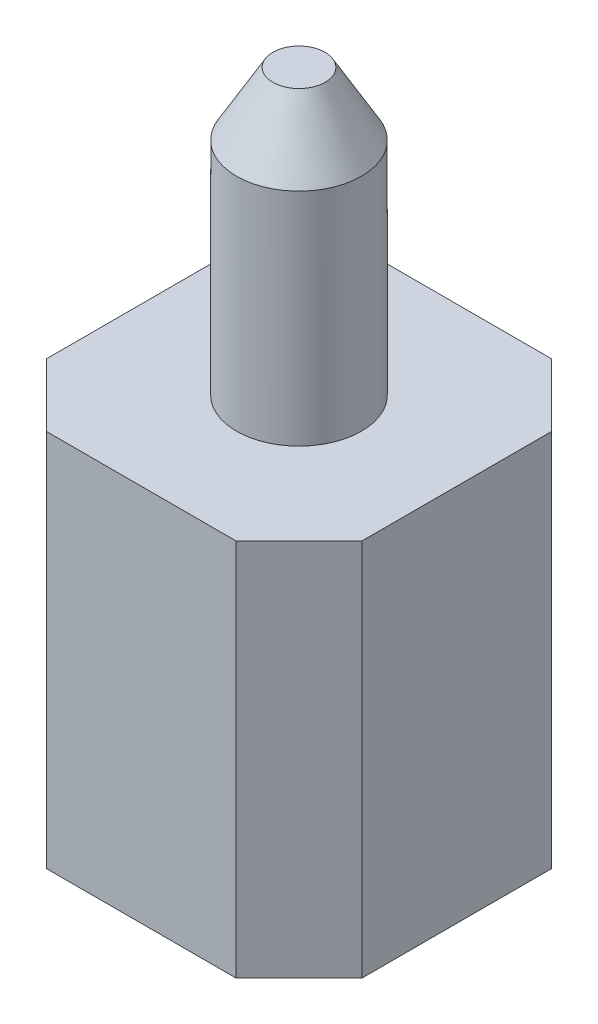
ISO-10303-21;
HEADER;
FILE_DESCRIPTION(('STEP AP214'),'2;1');
FILE_NAME('part.step','',(''),(''),'','','');
FILE_SCHEMA(('AUTOMOTIVE_DESIGN { 1 0 10303 214 1 1 1 1 }'));
ENDSEC;
DATA;
#1=APPLICATION_CONTEXT('core data for automotive mechanical design processes');
#2=APPLICATION_PROTOCOL_DEFINITION('international standard','automotive_design',2000,#1);
#3=PRODUCT_CONTEXT('',#1,'mechanical');
#4=PRODUCT('Part','Part','',(#3));
#5=PRODUCT_RELATED_PRODUCT_CATEGORY('part','',(#4));
#6=PRODUCT_DEFINITION_FORMATION('','',#4);
#7=PRODUCT_DEFINITION_CONTEXT('part definition',#1,'design');
#8=PRODUCT_DEFINITION('design','',#6,#7);
#9=PRODUCT_DEFINITION_SHAPE('','',#8);
#10=(LENGTH_UNIT() NAMED_UNIT(*) SI_UNIT(.MILLI.,.METRE.));
#11=(NAMED_UNIT(*) PLANE_ANGLE_UNIT() SI_UNIT($,.RADIAN.));
#12=(NAMED_UNIT(*) SI_UNIT($,.STERADIAN.) SOLID_ANGLE_UNIT());
#13=UNCERTAINTY_MEASURE_WITH_UNIT(LENGTH_MEASURE(1.E-05),#10,'distance_accuracy_value','');
#14=(GEOMETRIC_REPRESENTATION_CONTEXT(3) GLOBAL_UNCERTAINTY_ASSIGNED_CONTEXT((#13)) GLOBAL_UNIT_ASSIGNED_CONTEXT((#10,
#11,#12)) REPRESENTATION_CONTEXT('',''));
#15=CARTESIAN_POINT('',(0.,0.,0.));
#16=DIRECTION('',(0.,0.,1.));
#17=DIRECTION('',(1.,0.,0.));
#18=AXIS2_PLACEMENT_3D('',#15,#16,#17);
#19=CARTESIAN_POINT('',(1.25000000000001,1.5,1.25));
#20=DIRECTION('',(0.,-1.,0.));
#21=DIRECTION('',(0.,0.,-1.));
#22=AXIS2_PLACEMENT_3D('',#19,#20,#21);
#23=PLANE('',#22);
#24=DIRECTION('',(-1.,0.,0.));
#25=VECTOR('',#24,1.);
#26=CARTESIAN_POINT('',(-1.25,1.5,-1.25));
#27=LINE('',#26,#25);
#28=CARTESIAN_POINT('',(0.75,1.5,-1.25));
#29=VERTEX_POINT('',#28);
#30=CARTESIAN_POINT('',(-0.75,1.5,-1.25));
#31=VERTEX_POINT('',#30);
#32=EDGE_CURVE('E179',#29,#31,#27,.T.);
#33=ORIENTED_EDGE('',*,*,#32,.T.);
#34=DIRECTION('',(0.707106781186549,0.,-0.707106781186546));
#35=VECTOR('',#34,1.);
#36=CARTESIAN_POINT('',(-1.25,1.5,-0.750000000000002));
#37=LINE('',#36,#35);
#38=CARTESIAN_POINT('',(-1.25,1.5,-0.750000000000002));
#39=VERTEX_POINT('',#38);
#40=EDGE_CURVE('E160',#31,#39,#37,.F.);
#41=ORIENTED_EDGE('',*,*,#40,.T.);
#42=DIRECTION('',(0.,0.,1.));
#43=VECTOR('',#42,1.);
#44=CARTESIAN_POINT('',(-1.25,1.5,-1.25));
#45=LINE('',#44,#43);
#46=CARTESIAN_POINT('',(-1.25,1.5,0.749999999999999));
#47=VERTEX_POINT('',#46);
#48=EDGE_CURVE('E123',#39,#47,#45,.T.);
#49=ORIENTED_EDGE('',*,*,#48,.T.);
#50=DIRECTION('',(-0.707106781186546,0.,-0.707106781186549));
#51=VECTOR('',#50,1.);
#52=CARTESIAN_POINT('',(-0.750000000000002,1.5,1.25));
#53=LINE('',#52,#51);
#54=CARTESIAN_POINT('',(-0.750000000000002,1.5,1.25));
#55=VERTEX_POINT('',#54);
#56=EDGE_CURVE('E155',#47,#55,#53,.F.);
#57=ORIENTED_EDGE('',*,*,#56,.T.);
#58=DIRECTION('',(1.,0.,0.));
#59=VECTOR('',#58,1.);
#60=CARTESIAN_POINT('',(-1.25,1.5,1.25));
#61=LINE('',#60,#59);
#62=CARTESIAN_POINT('',(0.750000000000007,1.5,1.25));
#63=VERTEX_POINT('',#62);
#64=EDGE_CURVE('E129',#55,#63,#61,.T.);
#65=ORIENTED_EDGE('',*,*,#64,.T.);
#66=DIRECTION('',(-0.707106781186549,0.,0.707106781186546));
#67=VECTOR('',#66,1.);
#68=CARTESIAN_POINT('',(1.25000000000001,1.5,0.750000000000003));
#69=LINE('',#68,#67);
#70=CARTESIAN_POINT('',(1.25000000000001,1.5,0.750000000000003));
#71=VERTEX_POINT('',#70);
#72=EDGE_CURVE('E59',#63,#71,#69,.F.);
#73=ORIENTED_EDGE('',*,*,#72,.T.);
#74=DIRECTION('',(0.,0.,-1.));
#75=VECTOR('',#74,1.);
#76=CARTESIAN_POINT('',(1.25,1.5,-1.25));
#77=LINE('',#76,#75);
#78=CARTESIAN_POINT('',(1.25,1.5,-0.75));
#79=VERTEX_POINT('',#78);
#80=EDGE_CURVE('E132',#71,#79,#77,.T.);
#81=ORIENTED_EDGE('',*,*,#80,.T.);
#82=DIRECTION('',(0.707106781186548,0.,0.707106781186547));
#83=VECTOR('',#82,1.);
#84=CARTESIAN_POINT('',(0.75,1.5,-1.25));
#85=LINE('',#84,#83);
#86=EDGE_CURVE('E158',#79,#29,#85,.F.);
#87=ORIENTED_EDGE('',*,*,#86,.T.);
#88=EDGE_LOOP('',(#33,#41,#49,#57,#65,#73,#81,#87));
#89=FACE_BOUND('',#88,.T.);
#90=CARTESIAN_POINT('',(0.,1.5,0.));
#91=DIRECTION('',(0.,-1.,0.));
#92=DIRECTION('',(0.,0.,-1.));
#93=AXIS2_PLACEMENT_3D('',#90,#91,#92);
#94=CIRCLE('',#93,0.4953);
#95=CARTESIAN_POINT('',(0.,1.5,-0.4953));
#96=VERTEX_POINT('',#95);
#97=EDGE_CURVE('E138',#96,#96,#94,.F.);
#98=ORIENTED_EDGE('',*,*,#97,.F.);
#99=EDGE_LOOP('',(#98));
#100=FACE_BOUND('',#99,.T.);
#101=ADVANCED_FACE('F37',(#89,#100),#23,.F.);
#102=CARTESIAN_POINT('',(-1.25,1.5,1.25));
#103=DIRECTION('',(0.,0.,-1.));
#104=DIRECTION('',(-1.,0.,0.));
#105=AXIS2_PLACEMENT_3D('',#102,#103,#104);
#106=PLANE('',#105);
#107=DIRECTION('',(1.,0.,0.));
#108=VECTOR('',#107,1.);
#109=CARTESIAN_POINT('',(-1.25,-1.5,1.25));
#110=LINE('',#109,#108);
#111=CARTESIAN_POINT('',(-0.750000000000002,-1.5,1.25));
#112=VERTEX_POINT('',#111);
#113=CARTESIAN_POINT('',(0.750000000000007,-1.5,1.25));
#114=VERTEX_POINT('',#113);
#115=EDGE_CURVE('E171',#112,#114,#110,.T.);
#116=ORIENTED_EDGE('',*,*,#115,.T.);
#117=DIRECTION('',(0.,1.,0.));
#118=VECTOR('',#117,1.);
#119=CARTESIAN_POINT('',(0.750000000000007,1.5,1.25));
#120=LINE('',#119,#118);
#121=EDGE_CURVE('E11',#114,#63,#120,.T.);
#122=ORIENTED_EDGE('',*,*,#121,.T.);
#123=ORIENTED_EDGE('',*,*,#64,.F.);
#124=DIRECTION('',(0.,-1.,0.));
#125=VECTOR('',#124,1.);
#126=CARTESIAN_POINT('',(-0.750000000000002,1.5,1.25));
#127=LINE('',#126,#125);
#128=EDGE_CURVE('E45',#55,#112,#127,.T.);
#129=ORIENTED_EDGE('',*,*,#128,.T.);
#130=EDGE_LOOP('',(#116,#122,#123,#129));
#131=FACE_BOUND('',#130,.T.);
#132=ADVANCED_FACE('F170',(#131),#106,.F.);
#133=CARTESIAN_POINT('',(1.25,1.5,-1.25));
#134=DIRECTION('',(-1.,0.,0.));
#135=DIRECTION('',(0.,0.,1.));
#136=AXIS2_PLACEMENT_3D('',#133,#134,#135);
#137=PLANE('',#136);
#138=DIRECTION('',(0.,0.,-1.));
#139=VECTOR('',#138,1.);
#140=CARTESIAN_POINT('',(1.25,-1.5,-1.25));
#141=LINE('',#140,#139);
#142=CARTESIAN_POINT('',(1.25000000000001,-1.5,0.750000000000003));
#143=VERTEX_POINT('',#142);
#144=CARTESIAN_POINT('',(1.25,-1.5,-0.75));
#145=VERTEX_POINT('',#144);
#146=EDGE_CURVE('E134',#143,#145,#141,.T.);
#147=ORIENTED_EDGE('',*,*,#146,.T.);
#148=DIRECTION('',(0.,1.,0.));
#149=VECTOR('',#148,1.);
#150=CARTESIAN_POINT('',(1.25,1.5,-0.75));
#151=LINE('',#150,#149);
#152=EDGE_CURVE('E52',#145,#79,#151,.T.);
#153=ORIENTED_EDGE('',*,*,#152,.T.);
#154=ORIENTED_EDGE('',*,*,#80,.F.);
#155=DIRECTION('',(0.,-1.,0.));
#156=VECTOR('',#155,1.);
#157=CARTESIAN_POINT('',(1.25000000000001,1.5,0.750000000000003));
#158=LINE('',#157,#156);
#159=EDGE_CURVE('E162',#71,#143,#158,.T.);
#160=ORIENTED_EDGE('',*,*,#159,.T.);
#161=EDGE_LOOP('',(#147,#153,#154,#160));
#162=FACE_BOUND('',#161,.T.);
#163=ADVANCED_FACE('F191',(#162),#137,.F.);
#164=CARTESIAN_POINT('',(-1.25,1.5,-1.25));
#165=DIRECTION('',(0.,0.,1.));
#166=DIRECTION('',(1.,0.,0.));
#167=AXIS2_PLACEMENT_3D('',#164,#165,#166);
#168=PLANE('',#167);
#169=DIRECTION('',(-1.,0.,0.));
#170=VECTOR('',#169,1.);
#171=CARTESIAN_POINT('',(-1.25,-1.5,-1.25));
#172=LINE('',#171,#170);
#173=CARTESIAN_POINT('',(0.75,-1.5,-1.25));
#174=VERTEX_POINT('',#173);
#175=CARTESIAN_POINT('',(-0.75,-1.5,-1.25));
#176=VERTEX_POINT('',#175);
#177=EDGE_CURVE('E130',#174,#176,#172,.T.);
#178=ORIENTED_EDGE('',*,*,#177,.T.);
#179=DIRECTION('',(0.,1.,0.));
#180=VECTOR('',#179,1.);
#181=CARTESIAN_POINT('',(-0.75,1.5,-1.25));
#182=LINE('',#181,#180);
#183=EDGE_CURVE('E108',#176,#31,#182,.T.);
#184=ORIENTED_EDGE('',*,*,#183,.T.);
#185=ORIENTED_EDGE('',*,*,#32,.F.);
#186=DIRECTION('',(0.,-1.,0.));
#187=VECTOR('',#186,1.);
#188=CARTESIAN_POINT('',(0.75,1.5,-1.25));
#189=LINE('',#188,#187);
#190=EDGE_CURVE('E113',#29,#174,#189,.T.);
#191=ORIENTED_EDGE('',*,*,#190,.T.);
#192=EDGE_LOOP('',(#178,#184,#185,#191));
#193=FACE_BOUND('',#192,.T.);
#194=ADVANCED_FACE('F190',(#193),#168,.F.);
#195=CARTESIAN_POINT('',(-1.25,1.5,-1.25));
#196=DIRECTION('',(1.,0.,0.));
#197=DIRECTION('',(0.,0.,-1.));
#198=AXIS2_PLACEMENT_3D('',#195,#196,#197);
#199=PLANE('',#198);
#200=ORIENTED_EDGE('',*,*,#48,.F.);
#201=DIRECTION('',(0.,-1.,0.));
#202=VECTOR('',#201,1.);
#203=CARTESIAN_POINT('',(-1.25,1.5,-0.750000000000002));
#204=LINE('',#203,#202);
#205=CARTESIAN_POINT('',(-1.25,-1.5,-0.750000000000002));
#206=VERTEX_POINT('',#205);
#207=EDGE_CURVE('E107',#39,#206,#204,.T.);
#208=ORIENTED_EDGE('',*,*,#207,.T.);
#209=DIRECTION('',(0.,0.,1.));
#210=VECTOR('',#209,1.);
#211=CARTESIAN_POINT('',(-1.25,-1.5,-1.25));
#212=LINE('',#211,#210);
#213=CARTESIAN_POINT('',(-1.25,-1.5,0.75));
#214=VERTEX_POINT('',#213);
#215=EDGE_CURVE('E120',#206,#214,#212,.T.);
#216=ORIENTED_EDGE('',*,*,#215,.T.);
#217=DIRECTION('',(0.,1.,0.));
#218=VECTOR('',#217,1.);
#219=CARTESIAN_POINT('',(-1.25,1.5,0.75));
#220=LINE('',#219,#218);
#221=EDGE_CURVE('E125',#214,#47,#220,.T.);
#222=ORIENTED_EDGE('',*,*,#221,.T.);
#223=EDGE_LOOP('',(#200,#208,#216,#222));
#224=FACE_BOUND('',#223,.T.);
#225=ADVANCED_FACE('F119',(#224),#199,.F.);
#226=CARTESIAN_POINT('',(1.25000000000001,-1.5,1.25));
#227=DIRECTION('',(0.,-1.,0.));
#228=DIRECTION('',(0.,0.,-1.));
#229=AXIS2_PLACEMENT_3D('',#226,#227,#228);
#230=PLANE('',#229);
#231=ORIENTED_EDGE('',*,*,#215,.F.);
#232=DIRECTION('',(-0.707106781186549,0.,0.707106781186546));
#233=VECTOR('',#232,1.);
#234=CARTESIAN_POINT('',(-0.999999999999994,-1.5,-1.00000000000001));
#235=LINE('',#234,#233);
#236=EDGE_CURVE('E103',#206,#176,#235,.F.);
#237=ORIENTED_EDGE('',*,*,#236,.T.);
#238=ORIENTED_EDGE('',*,*,#177,.F.);
#239=DIRECTION('',(-0.707106781186548,0.,-0.707106781186547));
#240=VECTOR('',#239,1.);
#241=CARTESIAN_POINT('',(2.25000000000001,-1.5,0.250000000000002));
#242=LINE('',#241,#240);
#243=EDGE_CURVE('E114',#174,#145,#242,.F.);
#244=ORIENTED_EDGE('',*,*,#243,.T.);
#245=ORIENTED_EDGE('',*,*,#146,.F.);
#246=DIRECTION('',(0.707106781186549,0.,-0.707106781186546));
#247=VECTOR('',#246,1.);
#248=CARTESIAN_POINT('',(1.00000000000001,-1.5,1.));
#249=LINE('',#248,#247);
#250=EDGE_CURVE('E149',#143,#114,#249,.F.);
#251=ORIENTED_EDGE('',*,*,#250,.T.);
#252=ORIENTED_EDGE('',*,*,#115,.F.);
#253=DIRECTION('',(0.707106781186546,0.,0.707106781186549));
#254=VECTOR('',#253,1.);
#255=CARTESIAN_POINT('',(0.25,-1.5,2.25000000000001));
#256=LINE('',#255,#254);
#257=EDGE_CURVE('E124',#112,#214,#256,.F.);
#258=ORIENTED_EDGE('',*,*,#257,.T.);
#259=EDGE_LOOP('',(#231,#237,#238,#244,#245,#251,#252,#258));
#260=FACE_BOUND('',#259,.T.);
#261=ADVANCED_FACE('F127',(#260),#230,.T.);
#262=CARTESIAN_POINT('',(0.,3.75,0.));
#263=DIRECTION('',(0.,-1.,0.));
#264=DIRECTION('',(0.,0.,-1.));
#265=AXIS2_PLACEMENT_3D('',#262,#263,#264);
#266=CYLINDRICAL_SURFACE('',#265,0.4953);
#267=CARTESIAN_POINT('',(0.,3.25,0.));
#268=DIRECTION('',(0.,1.,0.));
#269=DIRECTION('',(0.,0.,1.));
#270=AXIS2_PLACEMENT_3D('',#267,#268,#269);
#271=CIRCLE('',#270,0.4953);
#272=CARTESIAN_POINT('',(0.,3.25,0.4953));
#273=VERTEX_POINT('',#272);
#274=EDGE_CURVE('E144',#273,#273,#271,.F.);
#275=ORIENTED_EDGE('',*,*,#274,.T.);
#276=EDGE_LOOP('',(#275));
#277=FACE_BOUND('',#276,.T.);
#278=ORIENTED_EDGE('',*,*,#97,.T.);
#279=EDGE_LOOP('',(#278));
#280=FACE_BOUND('',#279,.T.);
#281=ADVANCED_FACE('F206',(#277,#280),#266,.T.);
#282=CARTESIAN_POINT('',(-2.89142135623731,3.75,0.));
#283=DIRECTION('',(0.,1.,0.));
#284=DIRECTION('',(0.,0.,1.));
#285=AXIS2_PLACEMENT_3D('',#282,#283,#284);
#286=PLANE('',#285);
#287=CARTESIAN_POINT('',(0.,3.75,0.));
#288=DIRECTION('',(0.,1.,0.));
#289=DIRECTION('',(0.,0.,1.));
#290=AXIS2_PLACEMENT_3D('',#287,#288,#289);
#291=CIRCLE('',#290,0.206624865405188);
#292=CARTESIAN_POINT('',(0.,3.75,0.206624865405188));
#293=VERTEX_POINT('',#292);
#294=EDGE_CURVE('E141',#293,#293,#291,.T.);
#295=ORIENTED_EDGE('',*,*,#294,.T.);
#296=EDGE_LOOP('',(#295));
#297=FACE_BOUND('',#296,.T.);
#298=ADVANCED_FACE('F219',(#297),#286,.T.);
#299=CARTESIAN_POINT('',(0.,3.75,0.));
#300=DIRECTION('',(0.,-1.,0.));
#301=DIRECTION('',(0.,0.,-1.));
#302=AXIS2_PLACEMENT_3D('',#299,#300,#301);
#303=CONICAL_SURFACE('',#302,0.206624865405188,0.523598775598297);
#304=ORIENTED_EDGE('',*,*,#274,.F.);
#305=EDGE_LOOP('',(#304));
#306=FACE_BOUND('',#305,.T.);
#307=ORIENTED_EDGE('',*,*,#294,.F.);
#308=EDGE_LOOP('',(#307));
#309=FACE_BOUND('',#308,.T.);
#310=ADVANCED_FACE('F216',(#306,#309),#303,.T.);
#311=CARTESIAN_POINT('',(-1.25,1.5,-0.750000000000002));
#312=DIRECTION('',(0.707106781186546,0.,0.707106781186549));
#313=DIRECTION('',(0.707106781186549,0.,-0.707106781186546));
#314=AXIS2_PLACEMENT_3D('',#311,#312,#313);
#315=PLANE('',#314);
#316=ORIENTED_EDGE('',*,*,#40,.F.);
#317=ORIENTED_EDGE('',*,*,#183,.F.);
#318=ORIENTED_EDGE('',*,*,#236,.F.);
#319=ORIENTED_EDGE('',*,*,#207,.F.);
#320=EDGE_LOOP('',(#316,#317,#318,#319));
#321=FACE_BOUND('',#320,.T.);
#322=ADVANCED_FACE('F106',(#321),#315,.F.);
#323=CARTESIAN_POINT('',(0.75,1.5,-1.25));
#324=DIRECTION('',(-0.707106781186547,0.,0.707106781186548));
#325=DIRECTION('',(0.707106781186548,0.,0.707106781186547));
#326=AXIS2_PLACEMENT_3D('',#323,#324,#325);
#327=PLANE('',#326);
#328=ORIENTED_EDGE('',*,*,#86,.F.);
#329=ORIENTED_EDGE('',*,*,#152,.F.);
#330=ORIENTED_EDGE('',*,*,#243,.F.);
#331=ORIENTED_EDGE('',*,*,#190,.F.);
#332=EDGE_LOOP('',(#328,#329,#330,#331));
#333=FACE_BOUND('',#332,.T.);
#334=ADVANCED_FACE('F188',(#333),#327,.F.);
#335=CARTESIAN_POINT('',(1.25000000000001,1.5,0.750000000000003));
#336=DIRECTION('',(-0.707106781186546,0.,-0.707106781186549));
#337=DIRECTION('',(-0.707106781186549,0.,0.707106781186546));
#338=AXIS2_PLACEMENT_3D('',#335,#336,#337);
#339=PLANE('',#338);
#340=ORIENTED_EDGE('',*,*,#72,.F.);
#341=ORIENTED_EDGE('',*,*,#121,.F.);
#342=ORIENTED_EDGE('',*,*,#250,.F.);
#343=ORIENTED_EDGE('',*,*,#159,.F.);
#344=EDGE_LOOP('',(#340,#341,#342,#343));
#345=FACE_BOUND('',#344,.T.);
#346=ADVANCED_FACE('F193',(#345),#339,.F.);
#347=CARTESIAN_POINT('',(-0.750000000000002,1.5,1.25));
#348=DIRECTION('',(0.707106781186549,0.,-0.707106781186546));
#349=DIRECTION('',(-0.707106781186546,0.,-0.707106781186549));
#350=AXIS2_PLACEMENT_3D('',#347,#348,#349);
#351=PLANE('',#350);
#352=ORIENTED_EDGE('',*,*,#56,.F.);
#353=ORIENTED_EDGE('',*,*,#221,.F.);
#354=ORIENTED_EDGE('',*,*,#257,.F.);
#355=ORIENTED_EDGE('',*,*,#128,.F.);
#356=EDGE_LOOP('',(#352,#353,#354,#355));
#357=FACE_BOUND('',#356,.T.);
#358=ADVANCED_FACE('F39',(#357),#351,.F.);
#359=CLOSED_SHELL('',(#101,#132,#163,#194,#225,#261,#281,#298,#310,#322,#334,#346,#358));
#360=MANIFOLD_SOLID_BREP('B2',#359);
#361=ADVANCED_BREP_SHAPE_REPRESENTATION('',(#18,#360),#14);
#362=SHAPE_DEFINITION_REPRESENTATION(#9,#361);
ENDSEC;
END-ISO-10303-21;
